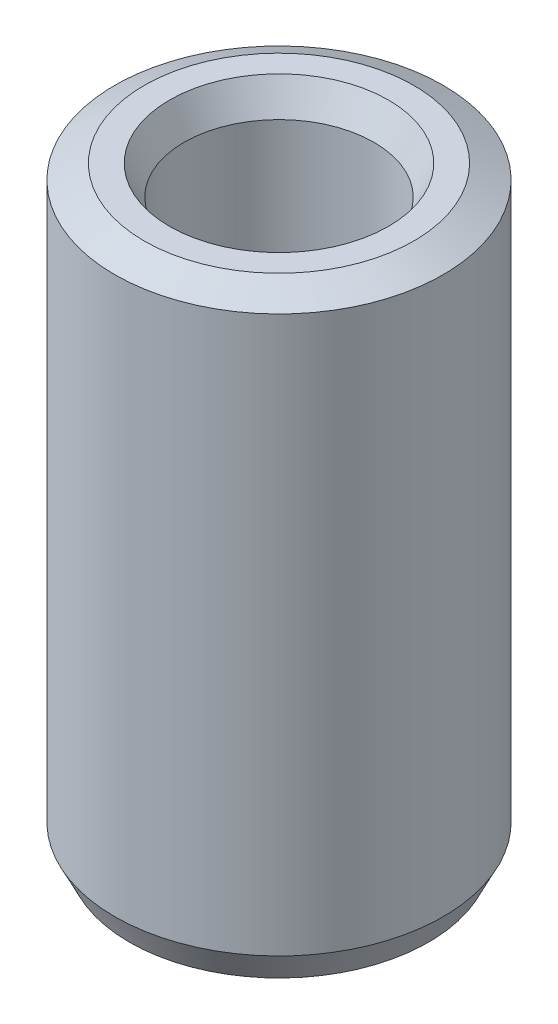
ISO-10303-21;
HEADER;
FILE_DESCRIPTION(('STEP AP214'),'2;1');
FILE_NAME('part.step','',(''),(''),'','','');
FILE_SCHEMA(('AUTOMOTIVE_DESIGN { 1 0 10303 214 1 1 1 1 }'));
ENDSEC;
DATA;
#1=APPLICATION_CONTEXT('core data for automotive mechanical design processes');
#2=APPLICATION_PROTOCOL_DEFINITION('international standard','automotive_design',2000,#1);
#3=PRODUCT_CONTEXT('',#1,'mechanical');
#4=PRODUCT('Part','Part','',(#3));
#5=PRODUCT_RELATED_PRODUCT_CATEGORY('part','',(#4));
#6=PRODUCT_DEFINITION_FORMATION('','',#4);
#7=PRODUCT_DEFINITION_CONTEXT('part definition',#1,'design');
#8=PRODUCT_DEFINITION('design','',#6,#7);
#9=PRODUCT_DEFINITION_SHAPE('','',#8);
#10=(LENGTH_UNIT() NAMED_UNIT(*) SI_UNIT(.MILLI.,.METRE.));
#11=(NAMED_UNIT(*) PLANE_ANGLE_UNIT() SI_UNIT($,.RADIAN.));
#12=(NAMED_UNIT(*) SI_UNIT($,.STERADIAN.) SOLID_ANGLE_UNIT());
#13=UNCERTAINTY_MEASURE_WITH_UNIT(LENGTH_MEASURE(1.E-05),#10,'distance_accuracy_value','');
#14=(GEOMETRIC_REPRESENTATION_CONTEXT(3) GLOBAL_UNCERTAINTY_ASSIGNED_CONTEXT((#13)) GLOBAL_UNIT_ASSIGNED_CONTEXT((#10,
#11,#12)) REPRESENTATION_CONTEXT('',''));
#15=CARTESIAN_POINT('',(0.,0.,0.));
#16=DIRECTION('',(0.,0.,1.));
#17=DIRECTION('',(1.,0.,0.));
#18=AXIS2_PLACEMENT_3D('',#15,#16,#17);
#19=CARTESIAN_POINT('',(0.,164.468646222661,0.));
#20=DIRECTION('',(0.,-1.,0.));
#21=DIRECTION('',(0.,0.,-1.));
#22=AXIS2_PLACEMENT_3D('',#19,#20,#21);
#23=CYLINDRICAL_SURFACE('',#22,45.);
#24=CARTESIAN_POINT('',(0.,8.04372429211594,0.));
#25=DIRECTION('',(0.,1.,0.));
#26=DIRECTION('',(0.,0.,1.));
#27=AXIS2_PLACEMENT_3D('',#24,#25,#26);
#28=CIRCLE('',#27,45.);
#29=CARTESIAN_POINT('',(0.,8.04372429211594,45.));
#30=VERTEX_POINT('',#29);
#31=EDGE_CURVE('E10',#30,#30,#28,.T.);
#32=ORIENTED_EDGE('',*,*,#31,.T.);
#33=EDGE_LOOP('',(#32));
#34=FACE_BOUND('',#33,.T.);
#35=CARTESIAN_POINT('',(0.,160.485159259434,0.));
#36=DIRECTION('',(0.,1.,0.));
#37=DIRECTION('',(0.,0.,1.));
#38=AXIS2_PLACEMENT_3D('',#35,#36,#37);
#39=CIRCLE('',#38,45.);
#40=CARTESIAN_POINT('',(0.,160.485159259434,45.));
#41=VERTEX_POINT('',#40);
#42=EDGE_CURVE('E50',#41,#41,#39,.F.);
#43=ORIENTED_EDGE('',*,*,#42,.T.);
#44=EDGE_LOOP('',(#43));
#45=FACE_BOUND('',#44,.T.);
#46=ADVANCED_FACE('F39',(#34,#45),#23,.T.);
#47=CARTESIAN_POINT('',(0.,164.468646222661,0.));
#48=DIRECTION('',(0.,1.,0.));
#49=DIRECTION('',(0.,0.,1.));
#50=AXIS2_PLACEMENT_3D('',#47,#48,#49);
#51=PLANE('',#50);
#52=CARTESIAN_POINT('',(0.,164.468646222661,0.));
#53=DIRECTION('',(0.,1.,0.));
#54=DIRECTION('',(0.,0.,1.));
#55=AXIS2_PLACEMENT_3D('',#52,#53,#54);
#56=CIRCLE('',#55,30.0161555685482);
#57=CARTESIAN_POINT('',(0.,164.468646222661,30.0161555685482));
#58=VERTEX_POINT('',#57);
#59=EDGE_CURVE('E58',#58,#58,#56,.F.);
#60=ORIENTED_EDGE('',*,*,#59,.T.);
#61=EDGE_LOOP('',(#60));
#62=FACE_BOUND('',#61,.T.);
#63=CARTESIAN_POINT('',(0.,164.468646222661,0.));
#64=DIRECTION('',(0.,1.,0.));
#65=DIRECTION('',(0.,0.,1.));
#66=AXIS2_PLACEMENT_3D('',#63,#64,#65);
#67=CIRCLE('',#66,36.9562757078841);
#68=CARTESIAN_POINT('',(0.,164.468646222661,36.9562757078841));
#69=VERTEX_POINT('',#68);
#70=EDGE_CURVE('E61',#69,#69,#67,.T.);
#71=ORIENTED_EDGE('',*,*,#70,.T.);
#72=EDGE_LOOP('',(#71));
#73=FACE_BOUND('',#72,.T.);
#74=ADVANCED_FACE('F88',(#62,#73),#51,.T.);
#75=CARTESIAN_POINT('',(0.,0.,0.));
#76=DIRECTION('',(0.,1.,0.));
#77=DIRECTION('',(0.,0.,1.));
#78=AXIS2_PLACEMENT_3D('',#75,#76,#77);
#79=PLANE('',#78);
#80=CARTESIAN_POINT('',(0.,0.,0.));
#81=DIRECTION('',(0.,1.,0.));
#82=DIRECTION('',(0.,0.,1.));
#83=AXIS2_PLACEMENT_3D('',#80,#81,#82);
#84=CIRCLE('',#83,34.0763928974372);
#85=CARTESIAN_POINT('',(0.,0.,34.0763928974372));
#86=VERTEX_POINT('',#85);
#87=EDGE_CURVE('E51',#86,#86,#84,.T.);
#88=ORIENTED_EDGE('',*,*,#87,.T.);
#89=EDGE_LOOP('',(#88));
#90=FACE_BOUND('',#89,.T.);
#91=CARTESIAN_POINT('',(0.,0.,0.));
#92=DIRECTION('',(0.,1.,0.));
#93=DIRECTION('',(0.,0.,1.));
#94=AXIS2_PLACEMENT_3D('',#91,#92,#93);
#95=CIRCLE('',#94,41.0165130367732);
#96=CARTESIAN_POINT('',(0.,0.,41.0165130367732));
#97=VERTEX_POINT('',#96);
#98=EDGE_CURVE('E54',#97,#97,#95,.F.);
#99=ORIENTED_EDGE('',*,*,#98,.T.);
#100=EDGE_LOOP('',(#99));
#101=FACE_BOUND('',#100,.T.);
#102=ADVANCED_FACE('F83',(#90,#101),#79,.F.);
#103=CARTESIAN_POINT('',(0.,164.468646222661,0.));
#104=DIRECTION('',(0.,-1.,0.));
#105=DIRECTION('',(0.,0.,-1.));
#106=AXIS2_PLACEMENT_3D('',#103,#104,#105);
#107=CYLINDRICAL_SURFACE('',#106,26.0326686053213);
#108=CARTESIAN_POINT('',(0.,156.424921930545,0.));
#109=DIRECTION('',(0.,1.,0.));
#110=DIRECTION('',(0.,0.,1.));
#111=AXIS2_PLACEMENT_3D('',#108,#109,#110);
#112=CIRCLE('',#111,26.0326686053213);
#113=CARTESIAN_POINT('',(0.,156.424921930545,26.0326686053213));
#114=VERTEX_POINT('',#113);
#115=EDGE_CURVE('E67',#114,#114,#112,.T.);
#116=ORIENTED_EDGE('',*,*,#115,.T.);
#117=EDGE_LOOP('',(#116));
#118=FACE_BOUND('',#117,.T.);
#119=CARTESIAN_POINT('',(0.,3.98348696322681,0.));
#120=DIRECTION('',(0.,1.,0.));
#121=DIRECTION('',(0.,0.,1.));
#122=AXIS2_PLACEMENT_3D('',#119,#120,#121);
#123=CIRCLE('',#122,26.0326686053213);
#124=CARTESIAN_POINT('',(0.,3.98348696322681,26.0326686053213));
#125=VERTEX_POINT('',#124);
#126=EDGE_CURVE('E69',#125,#125,#123,.F.);
#127=ORIENTED_EDGE('',*,*,#126,.T.);
#128=EDGE_LOOP('',(#127));
#129=FACE_BOUND('',#128,.T.);
#130=ADVANCED_FACE('F71',(#118,#129),#107,.F.);
#131=CARTESIAN_POINT('',(0.,156.424921930545,0.));
#132=DIRECTION('',(0.,1.,0.));
#133=DIRECTION('',(0.,0.,1.));
#134=AXIS2_PLACEMENT_3D('',#131,#132,#133);
#135=CONICAL_SURFACE('',#134,26.0326686053213,0.459823672075373);
#136=CARTESIAN_POINT('',(0.,164.468646222661,30.0161555685482));
#137=CARTESIAN_POINT('',(0.,164.384857427951,29.9746609126812));
#138=CARTESIAN_POINT('',(0.,164.301068633241,29.9331662568143));
#139=CARTESIAN_POINT('',(0.,164.133491043822,29.8501769450804));
#140=CARTESIAN_POINT('',(0.,164.049702249113,29.8086822892134));
#141=CARTESIAN_POINT('',(0.,163.882124659694,29.7256929774795));
#142=CARTESIAN_POINT('',(0.,163.798335864984,29.6841983216126));
#143=CARTESIAN_POINT('',(0.,163.630758275565,29.6012090098787));
#144=CARTESIAN_POINT('',(0.,163.546969480856,29.5597143540117));
#145=CARTESIAN_POINT('',(0.,163.379391891436,29.4767250422779));
#146=CARTESIAN_POINT('',(0.,163.295603096727,29.4352303864109));
#147=CARTESIAN_POINT('',(0.,163.128025507308,29.352241074677));
#148=CARTESIAN_POINT('',(0.,163.044236712598,29.3107464188101));
#149=CARTESIAN_POINT('',(0.,162.876659123179,29.2277571070762));
#150=CARTESIAN_POINT('',(0.,162.79287032847,29.1862624512092));
#151=CARTESIAN_POINT('',(0.,162.625292739051,29.1032731394753));
#152=CARTESIAN_POINT('',(0.,162.541503944341,29.0617784836084));
#153=CARTESIAN_POINT('',(0.,162.373926354922,28.9787891718745));
#154=CARTESIAN_POINT('',(0.,162.290137560212,28.9372945160076));
#155=CARTESIAN_POINT('',(0.,162.122559970793,28.8543052042737));
#156=CARTESIAN_POINT('',(0.,162.038771176084,28.8128105484067));
#157=CARTESIAN_POINT('',(0.,161.871193586665,28.7298212366728));
#158=CARTESIAN_POINT('',(0.,161.787404791955,28.6883265808059));
#159=CARTESIAN_POINT('',(0.,161.619827202536,28.605337269072));
#160=CARTESIAN_POINT('',(0.,161.536038407827,28.563842613205));
#161=CARTESIAN_POINT('',(0.,161.368460818408,28.4808533014712));
#162=CARTESIAN_POINT('',(0.,161.284672023698,28.4393586456042));
#163=CARTESIAN_POINT('',(0.,161.117094434279,28.3563693338703));
#164=CARTESIAN_POINT('',(0.,161.033305639569,28.3148746780034));
#165=CARTESIAN_POINT('',(0.,160.86572805015,28.2318853662695));
#166=CARTESIAN_POINT('',(0.,160.781939255441,28.1903907104025));
#167=CARTESIAN_POINT('',(0.,160.614361666022,28.1074013986686));
#168=CARTESIAN_POINT('',(0.,160.530572871312,28.0659067428017));
#169=CARTESIAN_POINT('',(0.,160.362995281893,27.9829174310678));
#170=CARTESIAN_POINT('',(0.,160.279206487184,27.9414227752009));
#171=CARTESIAN_POINT('',(0.,160.111628897764,27.858433463467));
#172=CARTESIAN_POINT('',(0.,160.027840103055,27.8169388076));
#173=CARTESIAN_POINT('',(0.,159.860262513636,27.7339494958661));
#174=CARTESIAN_POINT('',(0.,159.776473718926,27.6924548399992));
#175=CARTESIAN_POINT('',(0.,159.608896129507,27.6094655282653));
#176=CARTESIAN_POINT('',(0.,159.525107334798,27.5679708723983));
#177=CARTESIAN_POINT('',(0.,159.357529745379,27.4849815606644));
#178=CARTESIAN_POINT('',(0.,159.273740950669,27.4434869047975));
#179=CARTESIAN_POINT('',(0.,159.10616336125,27.3604975930636));
#180=CARTESIAN_POINT('',(0.,159.02237456654,27.3190029371967));
#181=CARTESIAN_POINT('',(0.,158.854796977121,27.2360136254628));
#182=CARTESIAN_POINT('',(0.,158.771008182412,27.1945189695958));
#183=CARTESIAN_POINT('',(0.,158.603430592993,27.1115296578619));
#184=CARTESIAN_POINT('',(0.,158.519641798283,27.070035001995));
#185=CARTESIAN_POINT('',(0.,158.352064208864,26.9870456902611));
#186=CARTESIAN_POINT('',(0.,158.268275414155,26.9455510343942));
#187=CARTESIAN_POINT('',(0.,158.100697824735,26.8625617226603));
#188=CARTESIAN_POINT('',(0.,158.016909030026,26.8210670667933));
#189=CARTESIAN_POINT('',(0.,157.849331440607,26.7380777550594));
#190=CARTESIAN_POINT('',(0.,157.765542645897,26.6965830991925));
#191=CARTESIAN_POINT('',(0.,157.597965056478,26.6135937874586));
#192=CARTESIAN_POINT('',(0.,157.514176261769,26.5720991315916));
#193=CARTESIAN_POINT('',(0.,157.34659867235,26.4891098198577));
#194=CARTESIAN_POINT('',(0.,157.26280987764,26.4476151639908));
#195=CARTESIAN_POINT('',(0.,157.095232288221,26.3646258522569));
#196=CARTESIAN_POINT('',(0.,157.011443493511,26.32313119639));
#197=CARTESIAN_POINT('',(0.,156.843865904092,26.2401418846561));
#198=CARTESIAN_POINT('',(0.,156.760077109383,26.1986472287891));
#199=CARTESIAN_POINT('',(0.,156.592499519964,26.1156579170552));
#200=CARTESIAN_POINT('',(0.,156.508710725254,26.0741632611883));
#201=CARTESIAN_POINT('',(0.,156.424921930545,26.0326686053213));
#202=B_SPLINE_CURVE_WITH_KNOTS('',3,(#136,#137,#138,#139,#140,#141,#142,#143,#144,#145,#146,
#147,#148,#149,#150,#151,#152,#153,#154,#155,#156,#157,#158,#159,#160,#161,#162,#163,#164,#165,
#166,#167,#168,#169,#170,#171,#172,#173,#174,#175,#176,#177,#178,#179,#180,#181,#182,#183,#184,
#185,#186,#187,#188,#189,#190,#191,#192,#193,#194,#195,#196,#197,#198,#199,#200,#201),
.UNSPECIFIED.,.F.,.F.,(4,2,2,2,2,2,2,2,2,2,2,2,2,2,2,2,2,2,2,2,2,2,2,2,2,2,2,2,2,2,2,2,4),(0.,
0.280501902416976,0.561003804833956,0.841505707250932,1.12200760966791,1.40250951208489,
1.68301141450187,1.96351331691884,2.24401521933582,2.5245171217528,2.80501902416978,
3.08552092658675,3.36602282900373,3.64652473142071,3.92702663383769,4.20752853625467,
4.48803043867162,4.7685323410886,5.04903424350557,5.32953614592255,5.61003804833953,
5.89053995075651,6.17104185317348,6.45154375559046,6.73204565800744,7.01254756042442,
7.2930494628414,7.57355136525837,7.85405326767535,8.13455517009233,8.41505707250931,
8.69555897492629,8.97606087734324),.UNSPECIFIED.);
#203=EDGE_CURVE('BSEAM77',#58,#114,#202,.T.);
#204=ORIENTED_EDGE('',*,*,#59,.F.);
#205=ORIENTED_EDGE('',*,*,#115,.F.);
#206=ORIENTED_EDGE('',*,*,#203,.T.);
#207=ORIENTED_EDGE('',*,*,#203,.F.);
#208=EDGE_LOOP('',(#204,#206,#205,#207));
#209=FACE_BOUND('',#208,.T.);
#210=ADVANCED_FACE('F77',(#209),#135,.F.);
#211=CARTESIAN_POINT('',(0.,0.,0.));
#212=DIRECTION('',(0.,-1.,0.));
#213=DIRECTION('',(0.,0.,-1.));
#214=AXIS2_PLACEMENT_3D('',#211,#212,#213);
#215=CONICAL_SURFACE('',#214,34.0763928974372,1.11097265471953);
#216=ORIENTED_EDGE('',*,*,#126,.F.);
#217=EDGE_LOOP('',(#216));
#218=FACE_BOUND('',#217,.T.);
#219=ORIENTED_EDGE('',*,*,#87,.F.);
#220=EDGE_LOOP('',(#219));
#221=FACE_BOUND('',#220,.T.);
#222=ADVANCED_FACE('F73',(#218,#221),#215,.F.);
#223=CARTESIAN_POINT('',(0.,8.04372429211594,0.));
#224=DIRECTION('',(0.,1.,0.));
#225=DIRECTION('',(0.,0.,1.));
#226=AXIS2_PLACEMENT_3D('',#223,#224,#225);
#227=CONICAL_SURFACE('',#226,45.,0.459823672075368);
#228=ORIENTED_EDGE('',*,*,#98,.F.);
#229=EDGE_LOOP('',(#228));
#230=FACE_BOUND('',#229,.T.);
#231=ORIENTED_EDGE('',*,*,#31,.F.);
#232=EDGE_LOOP('',(#231));
#233=FACE_BOUND('',#232,.T.);
#234=ADVANCED_FACE('F76',(#230,#233),#227,.T.);
#235=CARTESIAN_POINT('',(0.,164.468646222661,0.));
#236=DIRECTION('',(0.,-1.,0.));
#237=DIRECTION('',(0.,0.,-1.));
#238=AXIS2_PLACEMENT_3D('',#235,#236,#237);
#239=CONICAL_SURFACE('',#238,36.9562757078841,1.11097265471953);
#240=ORIENTED_EDGE('',*,*,#42,.F.);
#241=EDGE_LOOP('',(#240));
#242=FACE_BOUND('',#241,.T.);
#243=ORIENTED_EDGE('',*,*,#70,.F.);
#244=EDGE_LOOP('',(#243));
#245=FACE_BOUND('',#244,.T.);
#246=ADVANCED_FACE('F45',(#242,#245),#239,.T.);
#247=CLOSED_SHELL('',(#46,#74,#102,#130,#210,#222,#234,#246));
#248=MANIFOLD_SOLID_BREP('B2',#247);
#249=ADVANCED_BREP_SHAPE_REPRESENTATION('',(#18,#248),#14);
#250=SHAPE_DEFINITION_REPRESENTATION(#9,#249);
ENDSEC;
END-ISO-10303-21;
